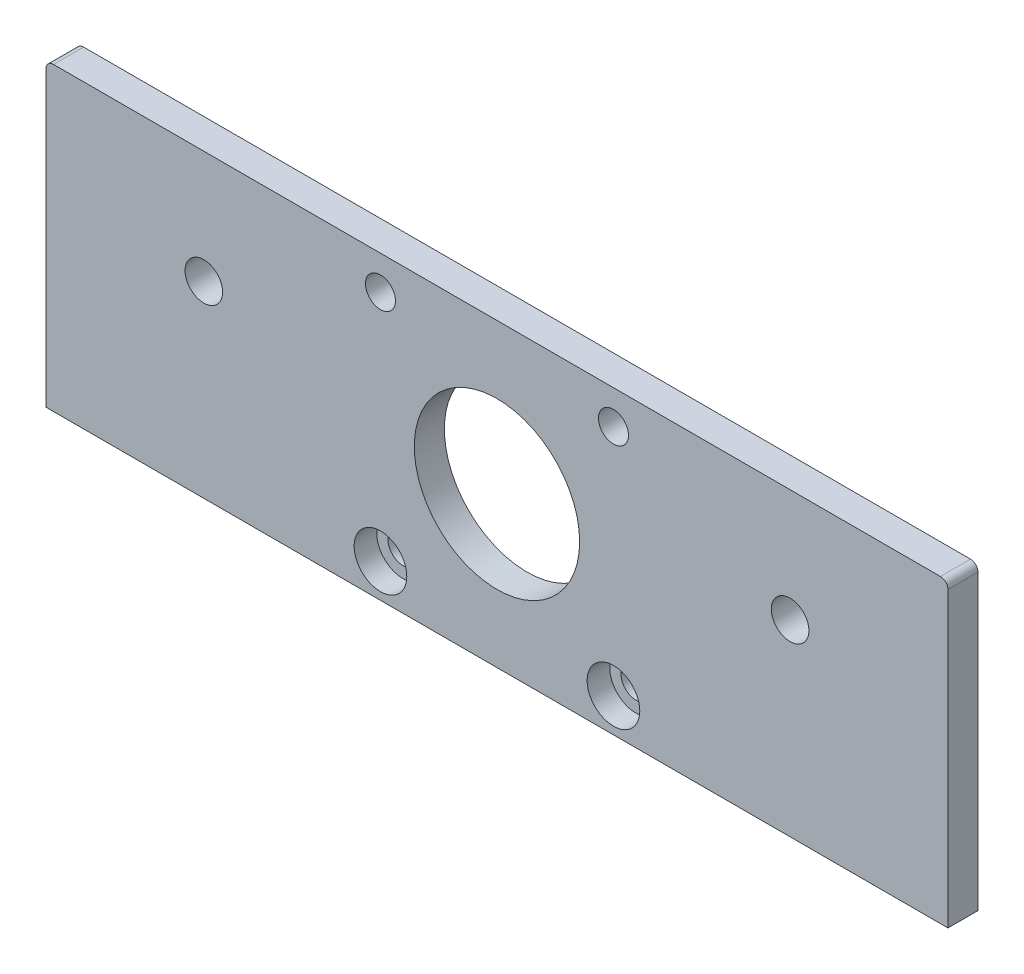
ISO-10303-21;
HEADER;
FILE_DESCRIPTION(('STEP AP214'),'2;1');
FILE_NAME('part.step','',(''),(''),'','','');
FILE_SCHEMA(('AUTOMOTIVE_DESIGN { 1 0 10303 214 1 1 1 1 }'));
ENDSEC;
DATA;
#1=APPLICATION_CONTEXT('core data for automotive mechanical design processes');
#2=APPLICATION_PROTOCOL_DEFINITION('international standard','automotive_design',2000,#1);
#3=PRODUCT_CONTEXT('',#1,'mechanical');
#4=PRODUCT('Part','Part','',(#3));
#5=PRODUCT_RELATED_PRODUCT_CATEGORY('part','',(#4));
#6=PRODUCT_DEFINITION_FORMATION('','',#4);
#7=PRODUCT_DEFINITION_CONTEXT('part definition',#1,'design');
#8=PRODUCT_DEFINITION('design','',#6,#7);
#9=PRODUCT_DEFINITION_SHAPE('','',#8);
#10=(LENGTH_UNIT() NAMED_UNIT(*) SI_UNIT(.MILLI.,.METRE.));
#11=(NAMED_UNIT(*) PLANE_ANGLE_UNIT() SI_UNIT($,.RADIAN.));
#12=(NAMED_UNIT(*) SI_UNIT($,.STERADIAN.) SOLID_ANGLE_UNIT());
#13=UNCERTAINTY_MEASURE_WITH_UNIT(LENGTH_MEASURE(1.E-05),#10,'distance_accuracy_value','');
#14=(GEOMETRIC_REPRESENTATION_CONTEXT(3) GLOBAL_UNCERTAINTY_ASSIGNED_CONTEXT((#13)) GLOBAL_UNIT_ASSIGNED_CONTEXT((#10,
#11,#12)) REPRESENTATION_CONTEXT('',''));
#15=CARTESIAN_POINT('',(0.,0.,0.));
#16=DIRECTION('',(0.,0.,1.));
#17=DIRECTION('',(1.,0.,0.));
#18=AXIS2_PLACEMENT_3D('',#15,#16,#17);
#19=CARTESIAN_POINT('',(75.4999999999999,4.4999999999992,4.));
#20=DIRECTION('',(0.,0.,-1.));
#21=DIRECTION('',(-1.,0.,0.));
#22=AXIS2_PLACEMENT_3D('',#19,#20,#21);
#23=CYLINDRICAL_SURFACE('',#22,2.);
#24=CARTESIAN_POINT('',(75.4999999999999,4.4999999999992,0.));
#25=DIRECTION('',(0.,0.,1.));
#26=DIRECTION('',(1.,0.,0.));
#27=AXIS2_PLACEMENT_3D('',#24,#25,#26);
#28=CIRCLE('',#27,2.);
#29=CARTESIAN_POINT('',(77.4999999999999,4.4999999999992,0.));
#30=VERTEX_POINT('',#29);
#31=EDGE_CURVE('E179',#30,#30,#28,.T.);
#32=ORIENTED_EDGE('',*,*,#31,.F.);
#33=EDGE_LOOP('',(#32));
#34=FACE_BOUND('',#33,.T.);
#35=CARTESIAN_POINT('',(75.4999999999999,4.4999999999992,1.));
#36=DIRECTION('',(0.,0.,1.));
#37=DIRECTION('',(1.,0.,0.));
#38=AXIS2_PLACEMENT_3D('',#35,#36,#37);
#39=CIRCLE('',#38,2.);
#40=CARTESIAN_POINT('',(77.4999999999999,4.4999999999992,1.));
#41=VERTEX_POINT('',#40);
#42=EDGE_CURVE('E56',#41,#41,#39,.T.);
#43=ORIENTED_EDGE('',*,*,#42,.T.);
#44=EDGE_LOOP('',(#43));
#45=FACE_BOUND('',#44,.T.);
#46=ADVANCED_FACE('F52',(#34,#45),#23,.F.);
#47=CARTESIAN_POINT('',(44.4999999999999,4.49999999999921,4.));
#48=DIRECTION('',(0.,0.,-1.));
#49=DIRECTION('',(-1.,0.,0.));
#50=AXIS2_PLACEMENT_3D('',#47,#48,#49);
#51=CYLINDRICAL_SURFACE('',#50,2.);
#52=CARTESIAN_POINT('',(44.4999999999999,4.49999999999921,0.));
#53=DIRECTION('',(0.,0.,1.));
#54=DIRECTION('',(1.,0.,0.));
#55=AXIS2_PLACEMENT_3D('',#52,#53,#54);
#56=CIRCLE('',#55,2.);
#57=CARTESIAN_POINT('',(46.4999999999999,4.49999999999921,0.));
#58=VERTEX_POINT('',#57);
#59=EDGE_CURVE('E170',#58,#58,#56,.T.);
#60=ORIENTED_EDGE('',*,*,#59,.F.);
#61=EDGE_LOOP('',(#60));
#62=FACE_BOUND('',#61,.T.);
#63=CARTESIAN_POINT('',(44.4999999999999,4.49999999999921,1.));
#64=DIRECTION('',(0.,0.,1.));
#65=DIRECTION('',(1.,0.,0.));
#66=AXIS2_PLACEMENT_3D('',#63,#64,#65);
#67=CIRCLE('',#66,2.);
#68=CARTESIAN_POINT('',(46.4999999999999,4.49999999999921,1.));
#69=VERTEX_POINT('',#68);
#70=EDGE_CURVE('E146',#69,#69,#67,.T.);
#71=ORIENTED_EDGE('',*,*,#70,.T.);
#72=EDGE_LOOP('',(#71));
#73=FACE_BOUND('',#72,.T.);
#74=ADVANCED_FACE('F236',(#62,#73),#51,.F.);
#75=CARTESIAN_POINT('',(0.,0.,4.));
#76=DIRECTION('',(0.,0.,-1.));
#77=DIRECTION('',(-1.,0.,0.));
#78=AXIS2_PLACEMENT_3D('',#75,#76,#77);
#79=PLANE('',#78);
#80=CARTESIAN_POINT('',(44.4999999999999,4.49999999999921,4.));
#81=DIRECTION('',(0.,0.,1.));
#82=DIRECTION('',(1.,0.,0.));
#83=AXIS2_PLACEMENT_3D('',#80,#81,#82);
#84=CIRCLE('',#83,3.5);
#85=CARTESIAN_POINT('',(47.9999999999999,4.49999999999921,4.));
#86=VERTEX_POINT('',#85);
#87=EDGE_CURVE('E154',#86,#86,#84,.T.);
#88=ORIENTED_EDGE('',*,*,#87,.F.);
#89=EDGE_LOOP('',(#88));
#90=FACE_BOUND('',#89,.T.);
#91=CARTESIAN_POINT('',(75.4999999999999,4.4999999999992,4.));
#92=DIRECTION('',(0.,0.,1.));
#93=DIRECTION('',(1.,0.,0.));
#94=AXIS2_PLACEMENT_3D('',#91,#92,#93);
#95=CIRCLE('',#94,3.50000000000001);
#96=CARTESIAN_POINT('',(78.9999999999999,4.4999999999992,4.));
#97=VERTEX_POINT('',#96);
#98=EDGE_CURVE('E164',#97,#97,#95,.T.);
#99=ORIENTED_EDGE('',*,*,#98,.F.);
#100=EDGE_LOOP('',(#99));
#101=FACE_BOUND('',#100,.T.);
#102=DIRECTION('',(0.,1.,0.));
#103=VECTOR('',#102,1.);
#104=CARTESIAN_POINT('',(120.,0.,4.));
#105=LINE('',#104,#103);
#106=CARTESIAN_POINT('',(120.,0.,4.));
#107=VERTEX_POINT('',#106);
#108=CARTESIAN_POINT('',(120.,39.,4.));
#109=VERTEX_POINT('',#108);
#110=EDGE_CURVE('E124',#107,#109,#105,.T.);
#111=ORIENTED_EDGE('',*,*,#110,.T.);
#112=CARTESIAN_POINT('',(119.,39.,4.));
#113=DIRECTION('',(0.,0.,-1.));
#114=DIRECTION('',(-1.,0.,0.));
#115=AXIS2_PLACEMENT_3D('',#112,#113,#114);
#116=CIRCLE('',#115,1.);
#117=CARTESIAN_POINT('',(119.,40.,4.));
#118=VERTEX_POINT('',#117);
#119=EDGE_CURVE('E61',#109,#118,#116,.F.);
#120=ORIENTED_EDGE('',*,*,#119,.T.);
#121=DIRECTION('',(-1.,0.,0.));
#122=VECTOR('',#121,1.);
#123=CARTESIAN_POINT('',(0.,40.,4.));
#124=LINE('',#123,#122);
#125=CARTESIAN_POINT('',(1.,40.,4.));
#126=VERTEX_POINT('',#125);
#127=EDGE_CURVE('E134',#118,#126,#124,.T.);
#128=ORIENTED_EDGE('',*,*,#127,.T.);
#129=CARTESIAN_POINT('',(1.,39.,4.));
#130=DIRECTION('',(0.,0.,-1.));
#131=DIRECTION('',(-1.,0.,0.));
#132=AXIS2_PLACEMENT_3D('',#129,#130,#131);
#133=CIRCLE('',#132,1.);
#134=CARTESIAN_POINT('',(0.,39.,4.));
#135=VERTEX_POINT('',#134);
#136=EDGE_CURVE('E69',#126,#135,#133,.F.);
#137=ORIENTED_EDGE('',*,*,#136,.T.);
#138=DIRECTION('',(0.,-1.,0.));
#139=VECTOR('',#138,1.);
#140=CARTESIAN_POINT('',(0.,0.,4.));
#141=LINE('',#140,#139);
#142=CARTESIAN_POINT('',(0.,0.,4.));
#143=VERTEX_POINT('',#142);
#144=EDGE_CURVE('E107',#135,#143,#141,.T.);
#145=ORIENTED_EDGE('',*,*,#144,.T.);
#146=DIRECTION('',(1.,0.,0.));
#147=VECTOR('',#146,1.);
#148=CARTESIAN_POINT('',(0.,0.,4.));
#149=LINE('',#148,#147);
#150=EDGE_CURVE('E111',#143,#107,#149,.T.);
#151=ORIENTED_EDGE('',*,*,#150,.T.);
#152=EDGE_LOOP('',(#111,#120,#128,#137,#145,#151));
#153=FACE_BOUND('',#152,.T.);
#154=CARTESIAN_POINT('',(21.0000000000001,25.0000000000007,4.));
#155=DIRECTION('',(0.,0.,1.));
#156=DIRECTION('',(1.,0.,0.));
#157=AXIS2_PLACEMENT_3D('',#154,#155,#156);
#158=CIRCLE('',#157,2.5);
#159=CARTESIAN_POINT('',(23.5000000000001,25.0000000000007,4.));
#160=VERTEX_POINT('',#159);
#161=EDGE_CURVE('E197',#160,#160,#158,.T.);
#162=ORIENTED_EDGE('',*,*,#161,.F.);
#163=EDGE_LOOP('',(#162));
#164=FACE_BOUND('',#163,.T.);
#165=CARTESIAN_POINT('',(99.0000000000001,25.0000000000007,4.));
#166=DIRECTION('',(0.,0.,1.));
#167=DIRECTION('',(1.,0.,0.));
#168=AXIS2_PLACEMENT_3D('',#165,#166,#167);
#169=CIRCLE('',#168,2.50000000000001);
#170=CARTESIAN_POINT('',(101.5,25.0000000000007,4.));
#171=VERTEX_POINT('',#170);
#172=EDGE_CURVE('E191',#171,#171,#169,.T.);
#173=ORIENTED_EDGE('',*,*,#172,.F.);
#174=EDGE_LOOP('',(#173));
#175=FACE_BOUND('',#174,.T.);
#176=CARTESIAN_POINT('',(60.,19.9999999999985,4.));
#177=DIRECTION('',(0.,0.,1.));
#178=DIRECTION('',(1.,0.,0.));
#179=AXIS2_PLACEMENT_3D('',#176,#177,#178);
#180=CIRCLE('',#179,11.);
#181=CARTESIAN_POINT('',(71.,19.9999999999985,4.));
#182=VERTEX_POINT('',#181);
#183=EDGE_CURVE('E185',#182,#182,#180,.T.);
#184=ORIENTED_EDGE('',*,*,#183,.F.);
#185=EDGE_LOOP('',(#184));
#186=FACE_BOUND('',#185,.T.);
#187=CARTESIAN_POINT('',(75.4999999999999,35.4999999999992,4.));
#188=DIRECTION('',(0.,0.,1.));
#189=DIRECTION('',(1.,0.,0.));
#190=AXIS2_PLACEMENT_3D('',#187,#188,#189);
#191=CIRCLE('',#190,2.);
#192=CARTESIAN_POINT('',(77.4999999999999,35.4999999999992,4.));
#193=VERTEX_POINT('',#192);
#194=EDGE_CURVE('E176',#193,#193,#191,.T.);
#195=ORIENTED_EDGE('',*,*,#194,.F.);
#196=EDGE_LOOP('',(#195));
#197=FACE_BOUND('',#196,.T.);
#198=CARTESIAN_POINT('',(44.4999999999999,35.4999999999992,4.));
#199=DIRECTION('',(0.,0.,1.));
#200=DIRECTION('',(1.,0.,0.));
#201=AXIS2_PLACEMENT_3D('',#198,#199,#200);
#202=CIRCLE('',#201,2.);
#203=CARTESIAN_POINT('',(46.4999999999999,35.4999999999992,4.));
#204=VERTEX_POINT('',#203);
#205=EDGE_CURVE('E167',#204,#204,#202,.T.);
#206=ORIENTED_EDGE('',*,*,#205,.F.);
#207=EDGE_LOOP('',(#206));
#208=FACE_BOUND('',#207,.T.);
#209=ADVANCED_FACE('F109',(#90,#101,#153,#164,#175,#186,#197,#208),#79,.F.);
#210=CARTESIAN_POINT('',(0.,0.,0.));
#211=DIRECTION('',(0.,0.,-1.));
#212=DIRECTION('',(-1.,0.,0.));
#213=AXIS2_PLACEMENT_3D('',#210,#211,#212);
#214=PLANE('',#213);
#215=ORIENTED_EDGE('',*,*,#59,.T.);
#216=EDGE_LOOP('',(#215));
#217=FACE_BOUND('',#216,.T.);
#218=ORIENTED_EDGE('',*,*,#31,.T.);
#219=EDGE_LOOP('',(#218));
#220=FACE_BOUND('',#219,.T.);
#221=CARTESIAN_POINT('',(99.0000000000001,25.0000000000007,0.));
#222=DIRECTION('',(0.,0.,1.));
#223=DIRECTION('',(1.,0.,0.));
#224=AXIS2_PLACEMENT_3D('',#221,#222,#223);
#225=CIRCLE('',#224,2.50000000000001);
#226=CARTESIAN_POINT('',(101.5,25.0000000000007,0.));
#227=VERTEX_POINT('',#226);
#228=EDGE_CURVE('E188',#227,#227,#225,.T.);
#229=ORIENTED_EDGE('',*,*,#228,.T.);
#230=EDGE_LOOP('',(#229));
#231=FACE_BOUND('',#230,.T.);
#232=DIRECTION('',(-1.,0.,0.));
#233=VECTOR('',#232,1.);
#234=CARTESIAN_POINT('',(0.,40.,0.));
#235=LINE('',#234,#233);
#236=CARTESIAN_POINT('',(119.,40.,0.));
#237=VERTEX_POINT('',#236);
#238=CARTESIAN_POINT('',(1.,40.,0.));
#239=VERTEX_POINT('',#238);
#240=EDGE_CURVE('E116',#237,#239,#235,.T.);
#241=ORIENTED_EDGE('',*,*,#240,.F.);
#242=CARTESIAN_POINT('',(119.,39.,0.));
#243=DIRECTION('',(0.,0.,-1.));
#244=DIRECTION('',(-1.,0.,0.));
#245=AXIS2_PLACEMENT_3D('',#242,#243,#244);
#246=CIRCLE('',#245,1.);
#247=CARTESIAN_POINT('',(120.,39.,0.));
#248=VERTEX_POINT('',#247);
#249=EDGE_CURVE('E142',#237,#248,#246,.T.);
#250=ORIENTED_EDGE('',*,*,#249,.T.);
#251=DIRECTION('',(0.,1.,0.));
#252=VECTOR('',#251,1.);
#253=CARTESIAN_POINT('',(120.,0.,0.));
#254=LINE('',#253,#252);
#255=CARTESIAN_POINT('',(120.,0.,0.));
#256=VERTEX_POINT('',#255);
#257=EDGE_CURVE('E207',#256,#248,#254,.T.);
#258=ORIENTED_EDGE('',*,*,#257,.F.);
#259=DIRECTION('',(1.,0.,0.));
#260=VECTOR('',#259,1.);
#261=CARTESIAN_POINT('',(0.,0.,0.));
#262=LINE('',#261,#260);
#263=CARTESIAN_POINT('',(0.,0.,0.));
#264=VERTEX_POINT('',#263);
#265=EDGE_CURVE('E205',#264,#256,#262,.T.);
#266=ORIENTED_EDGE('',*,*,#265,.F.);
#267=DIRECTION('',(0.,-1.,0.));
#268=VECTOR('',#267,1.);
#269=CARTESIAN_POINT('',(0.,0.,0.));
#270=LINE('',#269,#268);
#271=CARTESIAN_POINT('',(0.,39.,0.));
#272=VERTEX_POINT('',#271);
#273=EDGE_CURVE('E128',#272,#264,#270,.T.);
#274=ORIENTED_EDGE('',*,*,#273,.F.);
#275=CARTESIAN_POINT('',(1.,39.,0.));
#276=DIRECTION('',(0.,0.,-1.));
#277=DIRECTION('',(-1.,0.,0.));
#278=AXIS2_PLACEMENT_3D('',#275,#276,#277);
#279=CIRCLE('',#278,1.);
#280=EDGE_CURVE('E140',#272,#239,#279,.T.);
#281=ORIENTED_EDGE('',*,*,#280,.T.);
#282=EDGE_LOOP('',(#241,#250,#258,#266,#274,#281));
#283=FACE_BOUND('',#282,.T.);
#284=CARTESIAN_POINT('',(21.0000000000001,25.0000000000007,0.));
#285=DIRECTION('',(0.,0.,1.));
#286=DIRECTION('',(1.,0.,0.));
#287=AXIS2_PLACEMENT_3D('',#284,#285,#286);
#288=CIRCLE('',#287,2.5);
#289=CARTESIAN_POINT('',(23.5000000000001,25.0000000000007,0.));
#290=VERTEX_POINT('',#289);
#291=EDGE_CURVE('E194',#290,#290,#288,.T.);
#292=ORIENTED_EDGE('',*,*,#291,.T.);
#293=EDGE_LOOP('',(#292));
#294=FACE_BOUND('',#293,.T.);
#295=CARTESIAN_POINT('',(60.,19.9999999999985,0.));
#296=DIRECTION('',(0.,0.,1.));
#297=DIRECTION('',(1.,0.,0.));
#298=AXIS2_PLACEMENT_3D('',#295,#296,#297);
#299=CIRCLE('',#298,11.);
#300=CARTESIAN_POINT('',(71.,19.9999999999985,0.));
#301=VERTEX_POINT('',#300);
#302=EDGE_CURVE('E184',#301,#301,#299,.T.);
#303=ORIENTED_EDGE('',*,*,#302,.T.);
#304=EDGE_LOOP('',(#303));
#305=FACE_BOUND('',#304,.T.);
#306=CARTESIAN_POINT('',(75.4999999999999,35.4999999999992,0.));
#307=DIRECTION('',(0.,0.,1.));
#308=DIRECTION('',(1.,0.,0.));
#309=AXIS2_PLACEMENT_3D('',#306,#307,#308);
#310=CIRCLE('',#309,2.);
#311=CARTESIAN_POINT('',(77.4999999999999,35.4999999999992,0.));
#312=VERTEX_POINT('',#311);
#313=EDGE_CURVE('E175',#312,#312,#310,.T.);
#314=ORIENTED_EDGE('',*,*,#313,.T.);
#315=EDGE_LOOP('',(#314));
#316=FACE_BOUND('',#315,.T.);
#317=CARTESIAN_POINT('',(44.4999999999999,35.4999999999992,0.));
#318=DIRECTION('',(0.,0.,1.));
#319=DIRECTION('',(1.,0.,0.));
#320=AXIS2_PLACEMENT_3D('',#317,#318,#319);
#321=CIRCLE('',#320,2.);
#322=CARTESIAN_POINT('',(46.4999999999999,35.4999999999992,0.));
#323=VERTEX_POINT('',#322);
#324=EDGE_CURVE('E152',#323,#323,#321,.T.);
#325=ORIENTED_EDGE('',*,*,#324,.T.);
#326=EDGE_LOOP('',(#325));
#327=FACE_BOUND('',#326,.T.);
#328=ADVANCED_FACE('F217',(#217,#220,#231,#283,#294,#305,#316,#327),#214,.T.);
#329=CARTESIAN_POINT('',(0.,0.,4.));
#330=DIRECTION('',(1.,0.,0.));
#331=DIRECTION('',(0.,0.,-1.));
#332=AXIS2_PLACEMENT_3D('',#329,#330,#331);
#333=PLANE('',#332);
#334=ORIENTED_EDGE('',*,*,#144,.F.);
#335=DIRECTION('',(0.,0.,-1.));
#336=VECTOR('',#335,1.);
#337=CARTESIAN_POINT('',(0.,39.,4.));
#338=LINE('',#337,#336);
#339=EDGE_CURVE('E13',#135,#272,#338,.T.);
#340=ORIENTED_EDGE('',*,*,#339,.T.);
#341=ORIENTED_EDGE('',*,*,#273,.T.);
#342=DIRECTION('',(0.,0.,-1.));
#343=VECTOR('',#342,1.);
#344=CARTESIAN_POINT('',(0.,0.,4.));
#345=LINE('',#344,#343);
#346=EDGE_CURVE('E121',#143,#264,#345,.T.);
#347=ORIENTED_EDGE('',*,*,#346,.F.);
#348=EDGE_LOOP('',(#334,#340,#341,#347));
#349=FACE_BOUND('',#348,.T.);
#350=ADVANCED_FACE('F126',(#349),#333,.F.);
#351=CARTESIAN_POINT('',(0.,0.,4.));
#352=DIRECTION('',(0.,1.,0.));
#353=DIRECTION('',(0.,0.,1.));
#354=AXIS2_PLACEMENT_3D('',#351,#352,#353);
#355=PLANE('',#354);
#356=ORIENTED_EDGE('',*,*,#265,.T.);
#357=DIRECTION('',(0.,0.,-1.));
#358=VECTOR('',#357,1.);
#359=CARTESIAN_POINT('',(120.,0.,4.));
#360=LINE('',#359,#358);
#361=EDGE_CURVE('E123',#107,#256,#360,.T.);
#362=ORIENTED_EDGE('',*,*,#361,.F.);
#363=ORIENTED_EDGE('',*,*,#150,.F.);
#364=ORIENTED_EDGE('',*,*,#346,.T.);
#365=EDGE_LOOP('',(#356,#362,#363,#364));
#366=FACE_BOUND('',#365,.T.);
#367=ADVANCED_FACE('F120',(#366),#355,.F.);
#368=CARTESIAN_POINT('',(120.,0.,4.));
#369=DIRECTION('',(-1.,0.,0.));
#370=DIRECTION('',(0.,0.,1.));
#371=AXIS2_PLACEMENT_3D('',#368,#369,#370);
#372=PLANE('',#371);
#373=ORIENTED_EDGE('',*,*,#257,.T.);
#374=DIRECTION('',(0.,0.,-1.));
#375=VECTOR('',#374,1.);
#376=CARTESIAN_POINT('',(120.,39.,4.));
#377=LINE('',#376,#375);
#378=EDGE_CURVE('E77',#248,#109,#377,.F.);
#379=ORIENTED_EDGE('',*,*,#378,.T.);
#380=ORIENTED_EDGE('',*,*,#110,.F.);
#381=ORIENTED_EDGE('',*,*,#361,.T.);
#382=EDGE_LOOP('',(#373,#379,#380,#381));
#383=FACE_BOUND('',#382,.T.);
#384=ADVANCED_FACE('F220',(#383),#372,.F.);
#385=CARTESIAN_POINT('',(0.,40.,4.));
#386=DIRECTION('',(0.,-1.,0.));
#387=DIRECTION('',(0.,0.,-1.));
#388=AXIS2_PLACEMENT_3D('',#385,#386,#387);
#389=PLANE('',#388);
#390=ORIENTED_EDGE('',*,*,#127,.F.);
#391=DIRECTION('',(0.,0.,-1.));
#392=VECTOR('',#391,1.);
#393=CARTESIAN_POINT('',(119.,40.,4.));
#394=LINE('',#393,#392);
#395=EDGE_CURVE('E132',#118,#237,#394,.T.);
#396=ORIENTED_EDGE('',*,*,#395,.T.);
#397=ORIENTED_EDGE('',*,*,#240,.T.);
#398=DIRECTION('',(0.,0.,-1.));
#399=VECTOR('',#398,1.);
#400=CARTESIAN_POINT('',(1.,40.,4.));
#401=LINE('',#400,#399);
#402=EDGE_CURVE('E130',#239,#126,#401,.F.);
#403=ORIENTED_EDGE('',*,*,#402,.T.);
#404=EDGE_LOOP('',(#390,#396,#397,#403));
#405=FACE_BOUND('',#404,.T.);
#406=ADVANCED_FACE('F213',(#405),#389,.F.);
#407=CARTESIAN_POINT('',(21.0000000000001,25.0000000000007,4.));
#408=DIRECTION('',(0.,0.,-1.));
#409=DIRECTION('',(-1.,0.,0.));
#410=AXIS2_PLACEMENT_3D('',#407,#408,#409);
#411=CYLINDRICAL_SURFACE('',#410,2.5);
#412=ORIENTED_EDGE('',*,*,#161,.T.);
#413=EDGE_LOOP('',(#412));
#414=FACE_BOUND('',#413,.T.);
#415=ORIENTED_EDGE('',*,*,#291,.F.);
#416=EDGE_LOOP('',(#415));
#417=FACE_BOUND('',#416,.T.);
#418=ADVANCED_FACE('F255',(#414,#417),#411,.F.);
#419=CARTESIAN_POINT('',(99.0000000000001,25.0000000000007,4.));
#420=DIRECTION('',(0.,0.,-1.));
#421=DIRECTION('',(-1.,0.,0.));
#422=AXIS2_PLACEMENT_3D('',#419,#420,#421);
#423=CYLINDRICAL_SURFACE('',#422,2.50000000000001);
#424=ORIENTED_EDGE('',*,*,#172,.T.);
#425=EDGE_LOOP('',(#424));
#426=FACE_BOUND('',#425,.T.);
#427=ORIENTED_EDGE('',*,*,#228,.F.);
#428=EDGE_LOOP('',(#427));
#429=FACE_BOUND('',#428,.T.);
#430=ADVANCED_FACE('F251',(#426,#429),#423,.F.);
#431=CARTESIAN_POINT('',(60.,19.9999999999985,4.));
#432=DIRECTION('',(0.,0.,-1.));
#433=DIRECTION('',(-1.,0.,0.));
#434=AXIS2_PLACEMENT_3D('',#431,#432,#433);
#435=CYLINDRICAL_SURFACE('',#434,11.);
#436=ORIENTED_EDGE('',*,*,#183,.T.);
#437=EDGE_LOOP('',(#436));
#438=FACE_BOUND('',#437,.T.);
#439=ORIENTED_EDGE('',*,*,#302,.F.);
#440=EDGE_LOOP('',(#439));
#441=FACE_BOUND('',#440,.T.);
#442=ADVANCED_FACE('F248',(#438,#441),#435,.F.);
#443=CARTESIAN_POINT('',(75.4999999999999,35.4999999999992,4.));
#444=DIRECTION('',(0.,0.,-1.));
#445=DIRECTION('',(-1.,0.,0.));
#446=AXIS2_PLACEMENT_3D('',#443,#444,#445);
#447=CYLINDRICAL_SURFACE('',#446,2.);
#448=ORIENTED_EDGE('',*,*,#194,.T.);
#449=EDGE_LOOP('',(#448));
#450=FACE_BOUND('',#449,.T.);
#451=ORIENTED_EDGE('',*,*,#313,.F.);
#452=EDGE_LOOP('',(#451));
#453=FACE_BOUND('',#452,.T.);
#454=ADVANCED_FACE('F231',(#450,#453),#447,.F.);
#455=CARTESIAN_POINT('',(44.4999999999999,35.4999999999992,4.));
#456=DIRECTION('',(0.,0.,-1.));
#457=DIRECTION('',(-1.,0.,0.));
#458=AXIS2_PLACEMENT_3D('',#455,#456,#457);
#459=CYLINDRICAL_SURFACE('',#458,2.);
#460=ORIENTED_EDGE('',*,*,#205,.T.);
#461=EDGE_LOOP('',(#460));
#462=FACE_BOUND('',#461,.T.);
#463=ORIENTED_EDGE('',*,*,#324,.F.);
#464=EDGE_LOOP('',(#463));
#465=FACE_BOUND('',#464,.T.);
#466=ADVANCED_FACE('F225',(#462,#465),#459,.F.);
#467=CARTESIAN_POINT('',(119.,39.,4.));
#468=DIRECTION('',(0.,0.,-1.));
#469=DIRECTION('',(-1.,0.,0.));
#470=AXIS2_PLACEMENT_3D('',#467,#468,#469);
#471=CYLINDRICAL_SURFACE('',#470,1.);
#472=ORIENTED_EDGE('',*,*,#119,.F.);
#473=ORIENTED_EDGE('',*,*,#378,.F.);
#474=ORIENTED_EDGE('',*,*,#249,.F.);
#475=ORIENTED_EDGE('',*,*,#395,.F.);
#476=EDGE_LOOP('',(#472,#473,#474,#475));
#477=FACE_BOUND('',#476,.T.);
#478=ADVANCED_FACE('F223',(#477),#471,.T.);
#479=CARTESIAN_POINT('',(1.,39.,4.));
#480=DIRECTION('',(0.,0.,-1.));
#481=DIRECTION('',(-1.,0.,0.));
#482=AXIS2_PLACEMENT_3D('',#479,#480,#481);
#483=CYLINDRICAL_SURFACE('',#482,1.);
#484=ORIENTED_EDGE('',*,*,#136,.F.);
#485=ORIENTED_EDGE('',*,*,#402,.F.);
#486=ORIENTED_EDGE('',*,*,#280,.F.);
#487=ORIENTED_EDGE('',*,*,#339,.F.);
#488=EDGE_LOOP('',(#484,#485,#486,#487));
#489=FACE_BOUND('',#488,.T.);
#490=ADVANCED_FACE('F54',(#489),#483,.T.);
#491=CARTESIAN_POINT('',(44.4999999999999,4.49999999999921,1.));
#492=DIRECTION('',(0.,0.,1.));
#493=DIRECTION('',(1.,0.,0.));
#494=AXIS2_PLACEMENT_3D('',#491,#492,#493);
#495=CYLINDRICAL_SURFACE('',#494,3.5);
#496=CARTESIAN_POINT('',(44.4999999999999,4.49999999999921,1.));
#497=DIRECTION('',(0.,0.,1.));
#498=DIRECTION('',(1.,0.,0.));
#499=AXIS2_PLACEMENT_3D('',#496,#497,#498);
#500=CIRCLE('',#499,3.5);
#501=CARTESIAN_POINT('',(47.9999999999999,4.49999999999921,1.));
#502=VERTEX_POINT('',#501);
#503=EDGE_CURVE('E148',#502,#502,#500,.T.);
#504=ORIENTED_EDGE('',*,*,#503,.F.);
#505=EDGE_LOOP('',(#504));
#506=FACE_BOUND('',#505,.T.);
#507=ORIENTED_EDGE('',*,*,#87,.T.);
#508=EDGE_LOOP('',(#507));
#509=FACE_BOUND('',#508,.T.);
#510=ADVANCED_FACE('F230',(#506,#509),#495,.F.);
#511=CARTESIAN_POINT('',(44.4999999999999,4.49999999999921,1.));
#512=DIRECTION('',(0.,0.,1.));
#513=DIRECTION('',(1.,0.,0.));
#514=AXIS2_PLACEMENT_3D('',#511,#512,#513);
#515=PLANE('',#514);
#516=ORIENTED_EDGE('',*,*,#70,.F.);
#517=EDGE_LOOP('',(#516));
#518=FACE_BOUND('',#517,.T.);
#519=ORIENTED_EDGE('',*,*,#503,.T.);
#520=EDGE_LOOP('',(#519));
#521=FACE_BOUND('',#520,.T.);
#522=ADVANCED_FACE('F349',(#518,#521),#515,.T.);
#523=CARTESIAN_POINT('',(75.4999999999999,4.4999999999992,1.));
#524=DIRECTION('',(0.,0.,1.));
#525=DIRECTION('',(1.,0.,0.));
#526=AXIS2_PLACEMENT_3D('',#523,#524,#525);
#527=CYLINDRICAL_SURFACE('',#526,3.50000000000001);
#528=CARTESIAN_POINT('',(75.4999999999999,4.4999999999992,1.));
#529=DIRECTION('',(0.,0.,1.));
#530=DIRECTION('',(1.,0.,0.));
#531=AXIS2_PLACEMENT_3D('',#528,#529,#530);
#532=CIRCLE('',#531,3.50000000000001);
#533=CARTESIAN_POINT('',(78.9999999999999,4.4999999999992,1.));
#534=VERTEX_POINT('',#533);
#535=EDGE_CURVE('E159',#534,#534,#532,.T.);
#536=ORIENTED_EDGE('',*,*,#535,.F.);
#537=EDGE_LOOP('',(#536));
#538=FACE_BOUND('',#537,.T.);
#539=ORIENTED_EDGE('',*,*,#98,.T.);
#540=EDGE_LOOP('',(#539));
#541=FACE_BOUND('',#540,.T.);
#542=ADVANCED_FACE('F360',(#538,#541),#527,.F.);
#543=CARTESIAN_POINT('',(75.4999999999999,4.4999999999992,1.));
#544=DIRECTION('',(0.,0.,1.));
#545=DIRECTION('',(1.,0.,0.));
#546=AXIS2_PLACEMENT_3D('',#543,#544,#545);
#547=PLANE('',#546);
#548=ORIENTED_EDGE('',*,*,#42,.F.);
#549=EDGE_LOOP('',(#548));
#550=FACE_BOUND('',#549,.T.);
#551=ORIENTED_EDGE('',*,*,#535,.T.);
#552=EDGE_LOOP('',(#551));
#553=FACE_BOUND('',#552,.T.);
#554=ADVANCED_FACE('F370',(#550,#553),#547,.T.);
#555=CLOSED_SHELL('',(#46,#74,#209,#328,#350,#367,#384,#406,#418,#430,#442,#454,#466,#478,#490,
#510,#522,#542,#554));
#556=MANIFOLD_SOLID_BREP('B2',#555);
#557=ADVANCED_BREP_SHAPE_REPRESENTATION('',(#18,#556),#14);
#558=SHAPE_DEFINITION_REPRESENTATION(#9,#557);
ENDSEC;
END-ISO-10303-21;
